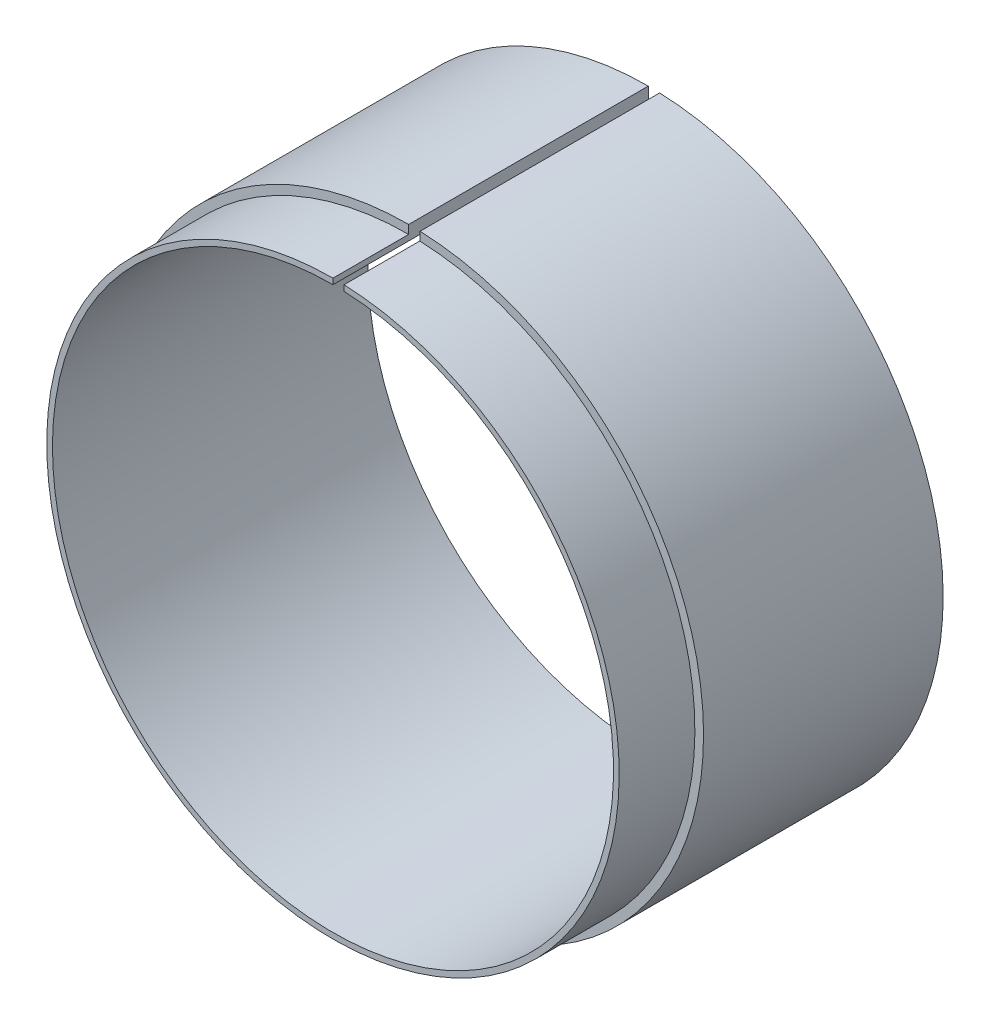
ISO-10303-21;
HEADER;
FILE_DESCRIPTION(('STEP AP214'),'2;1');
FILE_NAME('part.step','',(''),(''),'','','');
FILE_SCHEMA(('AUTOMOTIVE_DESIGN { 1 0 10303 214 1 1 1 1 }'));
ENDSEC;
DATA;
#1=APPLICATION_CONTEXT('core data for automotive mechanical design processes');
#2=APPLICATION_PROTOCOL_DEFINITION('international standard','automotive_design',2000,#1);
#3=PRODUCT_CONTEXT('',#1,'mechanical');
#4=PRODUCT('Part','Part','',(#3));
#5=PRODUCT_RELATED_PRODUCT_CATEGORY('part','',(#4));
#6=PRODUCT_DEFINITION_FORMATION('','',#4);
#7=PRODUCT_DEFINITION_CONTEXT('part definition',#1,'design');
#8=PRODUCT_DEFINITION('design','',#6,#7);
#9=PRODUCT_DEFINITION_SHAPE('','',#8);
#10=(LENGTH_UNIT() NAMED_UNIT(*) SI_UNIT(.MILLI.,.METRE.));
#11=(NAMED_UNIT(*) PLANE_ANGLE_UNIT() SI_UNIT($,.RADIAN.));
#12=(NAMED_UNIT(*) SI_UNIT($,.STERADIAN.) SOLID_ANGLE_UNIT());
#13=UNCERTAINTY_MEASURE_WITH_UNIT(LENGTH_MEASURE(1.E-05),#10,'distance_accuracy_value','');
#14=(GEOMETRIC_REPRESENTATION_CONTEXT(3) GLOBAL_UNCERTAINTY_ASSIGNED_CONTEXT((#13)) GLOBAL_UNIT_ASSIGNED_CONTEXT((#10,
#11,#12)) REPRESENTATION_CONTEXT('',''));
#15=CARTESIAN_POINT('',(0.,0.,0.));
#16=DIRECTION('',(0.,0.,1.));
#17=DIRECTION('',(1.,0.,0.));
#18=AXIS2_PLACEMENT_3D('',#15,#16,#17);
#19=CARTESIAN_POINT('',(0.,0.,110.));
#20=DIRECTION('',(0.,0.,-1.));
#21=DIRECTION('',(-1.,0.,0.));
#22=AXIS2_PLACEMENT_3D('',#19,#20,#21);
#23=CYLINDRICAL_SURFACE('',#22,102.86532072385);
#24=DIRECTION('',(0.,0.,-1.));
#25=VECTOR('',#24,1.);
#26=CARTESIAN_POINT('',(3.97173939662042,102.788615584538,110.));
#27=LINE('',#26,#25);
#28=CARTESIAN_POINT('',(3.97173939662042,102.788615584538,83.5869346860087));
#29=VERTEX_POINT('',#28);
#30=CARTESIAN_POINT('',(3.97173939662042,102.788615584538,0.));
#31=VERTEX_POINT('',#30);
#32=EDGE_CURVE('E115',#29,#31,#27,.T.);
#33=ORIENTED_EDGE('',*,*,#32,.F.);
#34=CARTESIAN_POINT('',(0.,0.,83.5869346860087));
#35=DIRECTION('',(0.,0.,-1.));
#36=DIRECTION('',(-1.,0.,0.));
#37=AXIS2_PLACEMENT_3D('',#34,#35,#36);
#38=CIRCLE('',#37,102.86532072385);
#39=CARTESIAN_POINT('',(0.,102.86532072385,83.5869346860087));
#40=VERTEX_POINT('',#39);
#41=EDGE_CURVE('E87',#29,#40,#38,.T.);
#42=ORIENTED_EDGE('',*,*,#41,.T.);
#43=DIRECTION('',(0.,0.,-1.));
#44=VECTOR('',#43,1.);
#45=CARTESIAN_POINT('',(0.,102.86532072385,110.));
#46=LINE('',#45,#44);
#47=CARTESIAN_POINT('',(0.,102.86532072385,0.));
#48=VERTEX_POINT('',#47);
#49=EDGE_CURVE('E80',#40,#48,#46,.T.);
#50=ORIENTED_EDGE('',*,*,#49,.T.);
#51=CARTESIAN_POINT('',(0.,0.,0.));
#52=DIRECTION('',(0.,0.,1.));
#53=DIRECTION('',(1.,0.,0.));
#54=AXIS2_PLACEMENT_3D('',#51,#52,#53);
#55=CIRCLE('',#54,102.86532072385);
#56=EDGE_CURVE('E83',#48,#31,#55,.T.);
#57=ORIENTED_EDGE('',*,*,#56,.T.);
#58=EDGE_LOOP('',(#33,#42,#50,#57));
#59=FACE_BOUND('',#58,.T.);
#60=ADVANCED_FACE('F37',(#59),#23,.T.);
#61=CARTESIAN_POINT('',(3.77868408076316,97.7923440101518,110.));
#62=DIRECTION('',(-0.999254314877234,0.0386110631714537,0.));
#63=DIRECTION('',(-0.0386110631714537,-0.999254314877234,0.));
#64=AXIS2_PLACEMENT_3D('',#61,#62,#63);
#65=PLANE('',#64);
#66=DIRECTION('',(0.,0.,-1.));
#67=VECTOR('',#66,1.);
#68=CARTESIAN_POINT('',(3.85531201918185,99.7754750564276,0.));
#69=LINE('',#68,#67);
#70=CARTESIAN_POINT('',(3.85531201918185,99.7754750564276,83.5869346860087));
#71=VERTEX_POINT('',#70);
#72=CARTESIAN_POINT('',(3.85531201918185,99.7754750564276,110.));
#73=VERTEX_POINT('',#72);
#74=EDGE_CURVE('E51',#71,#73,#69,.F.);
#75=ORIENTED_EDGE('',*,*,#74,.F.);
#76=DIRECTION('',(-0.0386110631714537,-0.999254314877234,0.));
#77=VECTOR('',#76,1.);
#78=CARTESIAN_POINT('',(3.77868408076316,97.7923440101518,83.5869346860087));
#79=LINE('',#78,#77);
#80=EDGE_CURVE('E99',#29,#71,#79,.T.);
#81=ORIENTED_EDGE('',*,*,#80,.F.);
#82=ORIENTED_EDGE('',*,*,#32,.T.);
#83=DIRECTION('',(0.0386110631714537,0.999254314877234,0.));
#84=VECTOR('',#83,1.);
#85=CARTESIAN_POINT('',(3.77868408076316,97.7923440101518,0.));
#86=LINE('',#85,#84);
#87=CARTESIAN_POINT('',(3.77868408076316,97.7923440101518,0.));
#88=VERTEX_POINT('',#87);
#89=EDGE_CURVE('E98',#88,#31,#86,.T.);
#90=ORIENTED_EDGE('',*,*,#89,.F.);
#91=DIRECTION('',(0.,0.,-1.));
#92=VECTOR('',#91,1.);
#93=CARTESIAN_POINT('',(3.77868408076316,97.7923440101518,110.));
#94=LINE('',#93,#92);
#95=CARTESIAN_POINT('',(3.77868408076316,97.7923440101518,110.));
#96=VERTEX_POINT('',#95);
#97=EDGE_CURVE('E113',#96,#88,#94,.T.);
#98=ORIENTED_EDGE('',*,*,#97,.F.);
#99=DIRECTION('',(0.0386110631714537,0.999254314877234,0.));
#100=VECTOR('',#99,1.);
#101=CARTESIAN_POINT('',(3.77868408076316,97.7923440101518,110.));
#102=LINE('',#101,#100);
#103=EDGE_CURVE('E103',#96,#73,#102,.T.);
#104=ORIENTED_EDGE('',*,*,#103,.T.);
#105=EDGE_LOOP('',(#75,#81,#82,#90,#98,#104));
#106=FACE_BOUND('',#105,.T.);
#107=ADVANCED_FACE('F144',(#106),#65,.T.);
#108=CARTESIAN_POINT('',(0.,0.,110.));
#109=DIRECTION('',(0.,0.,-1.));
#110=DIRECTION('',(-1.,0.,0.));
#111=AXIS2_PLACEMENT_3D('',#108,#109,#110);
#112=CYLINDRICAL_SURFACE('',#111,97.8653207238503);
#113=CARTESIAN_POINT('',(0.,0.,0.));
#114=DIRECTION('',(0.,0.,1.));
#115=DIRECTION('',(1.,0.,0.));
#116=AXIS2_PLACEMENT_3D('',#113,#114,#115);
#117=CIRCLE('',#116,97.8653207238503);
#118=CARTESIAN_POINT('',(0.,97.8653207238503,0.));
#119=VERTEX_POINT('',#118);
#120=EDGE_CURVE('E104',#119,#88,#117,.T.);
#121=ORIENTED_EDGE('',*,*,#120,.F.);
#122=DIRECTION('',(0.,0.,-1.));
#123=VECTOR('',#122,1.);
#124=CARTESIAN_POINT('',(0.,97.8653207238503,110.));
#125=LINE('',#124,#123);
#126=CARTESIAN_POINT('',(0.,97.8653207238503,110.));
#127=VERTEX_POINT('',#126);
#128=EDGE_CURVE('E90',#127,#119,#125,.T.);
#129=ORIENTED_EDGE('',*,*,#128,.F.);
#130=CARTESIAN_POINT('',(0.,0.,110.));
#131=DIRECTION('',(0.,0.,1.));
#132=DIRECTION('',(1.,0.,0.));
#133=AXIS2_PLACEMENT_3D('',#130,#131,#132);
#134=CIRCLE('',#133,97.8653207238503);
#135=EDGE_CURVE('E107',#127,#96,#134,.T.);
#136=ORIENTED_EDGE('',*,*,#135,.T.);
#137=ORIENTED_EDGE('',*,*,#97,.T.);
#138=EDGE_LOOP('',(#121,#129,#136,#137));
#139=FACE_BOUND('',#138,.T.);
#140=ADVANCED_FACE('F146',(#139),#112,.F.);
#141=CARTESIAN_POINT('',(0.,102.86532072385,110.));
#142=DIRECTION('',(1.,0.,0.));
#143=DIRECTION('',(0.,1.,0.));
#144=AXIS2_PLACEMENT_3D('',#141,#142,#143);
#145=PLANE('',#144);
#146=DIRECTION('',(0.,0.,-1.));
#147=VECTOR('',#146,1.);
#148=CARTESIAN_POINT('',(0.,99.8499316649793,0.));
#149=LINE('',#148,#147);
#150=CARTESIAN_POINT('',(0.,99.8499316649793,110.));
#151=VERTEX_POINT('',#150);
#152=CARTESIAN_POINT('',(0.,99.8499316649793,83.5869346860087));
#153=VERTEX_POINT('',#152);
#154=EDGE_CURVE('E120',#151,#153,#149,.T.);
#155=ORIENTED_EDGE('',*,*,#154,.F.);
#156=DIRECTION('',(0.,-1.,0.));
#157=VECTOR('',#156,1.);
#158=CARTESIAN_POINT('',(0.,102.86532072385,110.));
#159=LINE('',#158,#157);
#160=EDGE_CURVE('E60',#151,#127,#159,.T.);
#161=ORIENTED_EDGE('',*,*,#160,.T.);
#162=ORIENTED_EDGE('',*,*,#128,.T.);
#163=DIRECTION('',(0.,-1.,0.));
#164=VECTOR('',#163,1.);
#165=CARTESIAN_POINT('',(0.,102.86532072385,0.));
#166=LINE('',#165,#164);
#167=EDGE_CURVE('E96',#48,#119,#166,.T.);
#168=ORIENTED_EDGE('',*,*,#167,.F.);
#169=ORIENTED_EDGE('',*,*,#49,.F.);
#170=DIRECTION('',(0.,1.,0.));
#171=VECTOR('',#170,1.);
#172=CARTESIAN_POINT('',(0.,102.86532072385,83.5869346860087));
#173=LINE('',#172,#171);
#174=EDGE_CURVE('E11',#153,#40,#173,.T.);
#175=ORIENTED_EDGE('',*,*,#174,.F.);
#176=EDGE_LOOP('',(#155,#161,#162,#168,#169,#175));
#177=FACE_BOUND('',#176,.T.);
#178=ADVANCED_FACE('F101',(#177),#145,.T.);
#179=CARTESIAN_POINT('',(0.,0.,110.));
#180=DIRECTION('',(0.,0.,1.));
#181=DIRECTION('',(1.,0.,0.));
#182=AXIS2_PLACEMENT_3D('',#179,#180,#181);
#183=PLANE('',#182);
#184=CARTESIAN_POINT('',(0.,0.,110.));
#185=DIRECTION('',(0.,0.,1.));
#186=DIRECTION('',(1.,0.,0.));
#187=AXIS2_PLACEMENT_3D('',#184,#185,#186);
#188=CIRCLE('',#187,99.8499316649793);
#189=EDGE_CURVE('E44',#73,#151,#188,.F.);
#190=ORIENTED_EDGE('',*,*,#189,.F.);
#191=ORIENTED_EDGE('',*,*,#103,.F.);
#192=ORIENTED_EDGE('',*,*,#135,.F.);
#193=ORIENTED_EDGE('',*,*,#160,.F.);
#194=EDGE_LOOP('',(#190,#191,#192,#193));
#195=FACE_BOUND('',#194,.T.);
#196=ADVANCED_FACE('F129',(#195),#183,.T.);
#197=CARTESIAN_POINT('',(0.,0.,0.));
#198=DIRECTION('',(0.,0.,1.));
#199=DIRECTION('',(1.,0.,0.));
#200=AXIS2_PLACEMENT_3D('',#197,#198,#199);
#201=PLANE('',#200);
#202=ORIENTED_EDGE('',*,*,#56,.F.);
#203=ORIENTED_EDGE('',*,*,#167,.T.);
#204=ORIENTED_EDGE('',*,*,#120,.T.);
#205=ORIENTED_EDGE('',*,*,#89,.T.);
#206=EDGE_LOOP('',(#202,#203,#204,#205));
#207=FACE_BOUND('',#206,.T.);
#208=ADVANCED_FACE('F94',(#207),#201,.F.);
#209=CARTESIAN_POINT('',(0.,0.,0.));
#210=DIRECTION('',(0.,0.,-1.));
#211=DIRECTION('',(-1.,0.,0.));
#212=AXIS2_PLACEMENT_3D('',#209,#210,#211);
#213=CYLINDRICAL_SURFACE('',#212,99.8499316649793);
#214=ORIENTED_EDGE('',*,*,#74,.T.);
#215=ORIENTED_EDGE('',*,*,#189,.T.);
#216=ORIENTED_EDGE('',*,*,#154,.T.);
#217=CARTESIAN_POINT('',(0.,0.,83.5869346860087));
#218=DIRECTION('',(0.,0.,-1.));
#219=DIRECTION('',(-1.,0.,0.));
#220=AXIS2_PLACEMENT_3D('',#217,#218,#219);
#221=CIRCLE('',#220,99.8499316649793);
#222=EDGE_CURVE('E126',#71,#153,#221,.T.);
#223=ORIENTED_EDGE('',*,*,#222,.F.);
#224=EDGE_LOOP('',(#214,#215,#216,#223));
#225=FACE_BOUND('',#224,.T.);
#226=ADVANCED_FACE('F118',(#225),#213,.T.);
#227=CARTESIAN_POINT('',(0.,116.297147145509,83.5869346860087));
#228=DIRECTION('',(0.,0.,-1.));
#229=DIRECTION('',(-1.,0.,0.));
#230=AXIS2_PLACEMENT_3D('',#227,#228,#229);
#231=PLANE('',#230);
#232=ORIENTED_EDGE('',*,*,#80,.T.);
#233=ORIENTED_EDGE('',*,*,#222,.T.);
#234=ORIENTED_EDGE('',*,*,#174,.T.);
#235=ORIENTED_EDGE('',*,*,#41,.F.);
#236=EDGE_LOOP('',(#232,#233,#234,#235));
#237=FACE_BOUND('',#236,.T.);
#238=ADVANCED_FACE('F139',(#237),#231,.F.);
#239=CLOSED_SHELL('',(#60,#107,#140,#178,#196,#208,#226,#238));
#240=MANIFOLD_SOLID_BREP('B2',#239);
#241=ADVANCED_BREP_SHAPE_REPRESENTATION('',(#18,#240),#14);
#242=SHAPE_DEFINITION_REPRESENTATION(#9,#241);
ENDSEC;
END-ISO-10303-21;
